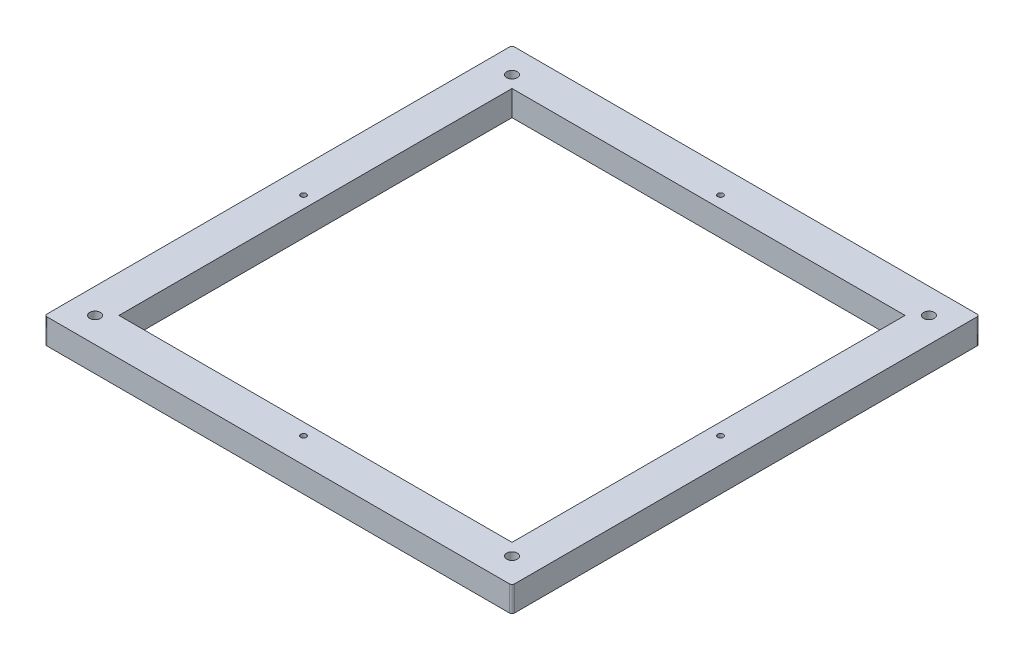
ISO-10303-21;
HEADER;
FILE_DESCRIPTION(('STEP AP214'),'2;1');
FILE_NAME('part.step','',(''),(''),'','','');
FILE_SCHEMA(('AUTOMOTIVE_DESIGN { 1 0 10303 214 1 1 1 1 }'));
ENDSEC;
DATA;
#1=APPLICATION_CONTEXT('core data for automotive mechanical design processes');
#2=APPLICATION_PROTOCOL_DEFINITION('international standard','automotive_design',2000,#1);
#3=PRODUCT_CONTEXT('',#1,'mechanical');
#4=PRODUCT('Part','Part','',(#3));
#5=PRODUCT_RELATED_PRODUCT_CATEGORY('part','',(#4));
#6=PRODUCT_DEFINITION_FORMATION('','',#4);
#7=PRODUCT_DEFINITION_CONTEXT('part definition',#1,'design');
#8=PRODUCT_DEFINITION('design','',#6,#7);
#9=PRODUCT_DEFINITION_SHAPE('','',#8);
#10=(LENGTH_UNIT() NAMED_UNIT(*) SI_UNIT(.MILLI.,.METRE.));
#11=(NAMED_UNIT(*) PLANE_ANGLE_UNIT() SI_UNIT($,.RADIAN.));
#12=(NAMED_UNIT(*) SI_UNIT($,.STERADIAN.) SOLID_ANGLE_UNIT());
#13=UNCERTAINTY_MEASURE_WITH_UNIT(LENGTH_MEASURE(1.E-05),#10,'distance_accuracy_value','');
#14=(GEOMETRIC_REPRESENTATION_CONTEXT(3) GLOBAL_UNCERTAINTY_ASSIGNED_CONTEXT((#13)) GLOBAL_UNIT_ASSIGNED_CONTEXT((#10,
#11,#12)) REPRESENTATION_CONTEXT('',''));
#15=CARTESIAN_POINT('',(0.,0.,0.));
#16=DIRECTION('',(0.,0.,1.));
#17=DIRECTION('',(1.,0.,0.));
#18=AXIS2_PLACEMENT_3D('',#15,#16,#17);
#19=CARTESIAN_POINT('',(-82.5,-10.,-82.5));
#20=DIRECTION('',(0.,1.,0.));
#21=DIRECTION('',(0.,0.,1.));
#22=AXIS2_PLACEMENT_3D('',#19,#20,#21);
#23=CYLINDRICAL_SURFACE('',#22,1.10000000000001);
#24=CARTESIAN_POINT('',(-82.5,-10.,-82.5));
#25=DIRECTION('',(0.,1.,0.));
#26=DIRECTION('',(0.,0.,1.));
#27=AXIS2_PLACEMENT_3D('',#24,#25,#26);
#28=CIRCLE('',#27,1.10000000000001);
#29=CARTESIAN_POINT('',(-82.5,-10.,-81.4));
#30=VERTEX_POINT('',#29);
#31=EDGE_CURVE('E156',#30,#30,#28,.T.);
#32=ORIENTED_EDGE('',*,*,#31,.F.);
#33=EDGE_LOOP('',(#32));
#34=FACE_BOUND('',#33,.T.);
#35=CARTESIAN_POINT('',(-82.5,-8.,-82.5));
#36=DIRECTION('',(0.,1.,0.));
#37=DIRECTION('',(0.,0.,1.));
#38=AXIS2_PLACEMENT_3D('',#35,#36,#37);
#39=CIRCLE('',#38,1.10000000000001);
#40=CARTESIAN_POINT('',(-82.5,-8.,-81.4));
#41=VERTEX_POINT('',#40);
#42=EDGE_CURVE('E38',#41,#41,#39,.F.);
#43=ORIENTED_EDGE('',*,*,#42,.F.);
#44=EDGE_LOOP('',(#43));
#45=FACE_BOUND('',#44,.T.);
#46=ADVANCED_FACE('F34',(#34,#45),#23,.F.);
#47=CARTESIAN_POINT('',(82.5,-10.,-82.5));
#48=DIRECTION('',(0.,1.,0.));
#49=DIRECTION('',(0.,0.,1.));
#50=AXIS2_PLACEMENT_3D('',#47,#48,#49);
#51=CYLINDRICAL_SURFACE('',#50,1.10000000000001);
#52=CARTESIAN_POINT('',(82.5,-10.,-82.5));
#53=DIRECTION('',(0.,1.,0.));
#54=DIRECTION('',(0.,0.,1.));
#55=AXIS2_PLACEMENT_3D('',#52,#53,#54);
#56=CIRCLE('',#55,1.10000000000001);
#57=CARTESIAN_POINT('',(82.5,-10.,-81.4));
#58=VERTEX_POINT('',#57);
#59=EDGE_CURVE('E272',#58,#58,#56,.T.);
#60=ORIENTED_EDGE('',*,*,#59,.F.);
#61=EDGE_LOOP('',(#60));
#62=FACE_BOUND('',#61,.T.);
#63=CARTESIAN_POINT('',(82.5,-8.,-82.5));
#64=DIRECTION('',(0.,1.,0.));
#65=DIRECTION('',(0.,0.,1.));
#66=AXIS2_PLACEMENT_3D('',#63,#64,#65);
#67=CIRCLE('',#66,1.10000000000001);
#68=CARTESIAN_POINT('',(82.5,-8.,-81.4));
#69=VERTEX_POINT('',#68);
#70=EDGE_CURVE('E231',#69,#69,#67,.F.);
#71=ORIENTED_EDGE('',*,*,#70,.F.);
#72=EDGE_LOOP('',(#71));
#73=FACE_BOUND('',#72,.T.);
#74=ADVANCED_FACE('F283',(#62,#73),#51,.F.);
#75=CARTESIAN_POINT('',(82.5,-10.,82.5));
#76=DIRECTION('',(0.,1.,0.));
#77=DIRECTION('',(0.,0.,1.));
#78=AXIS2_PLACEMENT_3D('',#75,#76,#77);
#79=CYLINDRICAL_SURFACE('',#78,1.10000000000001);
#80=CARTESIAN_POINT('',(82.5,-10.,82.5));
#81=DIRECTION('',(0.,1.,0.));
#82=DIRECTION('',(0.,0.,1.));
#83=AXIS2_PLACEMENT_3D('',#80,#81,#82);
#84=CIRCLE('',#83,1.10000000000001);
#85=CARTESIAN_POINT('',(82.5,-10.,83.6));
#86=VERTEX_POINT('',#85);
#87=EDGE_CURVE('E252',#86,#86,#84,.T.);
#88=ORIENTED_EDGE('',*,*,#87,.F.);
#89=EDGE_LOOP('',(#88));
#90=FACE_BOUND('',#89,.T.);
#91=CARTESIAN_POINT('',(82.5,-8.,82.5));
#92=DIRECTION('',(0.,1.,0.));
#93=DIRECTION('',(0.,0.,1.));
#94=AXIS2_PLACEMENT_3D('',#91,#92,#93);
#95=CIRCLE('',#94,1.10000000000001);
#96=CARTESIAN_POINT('',(82.5,-8.,83.6));
#97=VERTEX_POINT('',#96);
#98=EDGE_CURVE('E228',#97,#97,#95,.F.);
#99=ORIENTED_EDGE('',*,*,#98,.F.);
#100=EDGE_LOOP('',(#99));
#101=FACE_BOUND('',#100,.T.);
#102=ADVANCED_FACE('F288',(#90,#101),#79,.F.);
#103=CARTESIAN_POINT('',(-82.5,-10.,82.5));
#104=DIRECTION('',(0.,1.,0.));
#105=DIRECTION('',(0.,0.,1.));
#106=AXIS2_PLACEMENT_3D('',#103,#104,#105);
#107=CYLINDRICAL_SURFACE('',#106,1.10000000000001);
#108=CARTESIAN_POINT('',(-82.5,-10.,82.5));
#109=DIRECTION('',(0.,1.,0.));
#110=DIRECTION('',(0.,0.,1.));
#111=AXIS2_PLACEMENT_3D('',#108,#109,#110);
#112=CIRCLE('',#111,1.10000000000001);
#113=CARTESIAN_POINT('',(-82.5,-10.,83.6));
#114=VERTEX_POINT('',#113);
#115=EDGE_CURVE('E236',#114,#114,#112,.T.);
#116=ORIENTED_EDGE('',*,*,#115,.F.);
#117=EDGE_LOOP('',(#116));
#118=FACE_BOUND('',#117,.T.);
#119=CARTESIAN_POINT('',(-82.5,-8.,82.5));
#120=DIRECTION('',(0.,1.,0.));
#121=DIRECTION('',(0.,0.,1.));
#122=AXIS2_PLACEMENT_3D('',#119,#120,#121);
#123=CIRCLE('',#122,1.10000000000001);
#124=CARTESIAN_POINT('',(-82.5,-8.,83.6));
#125=VERTEX_POINT('',#124);
#126=EDGE_CURVE('E225',#125,#125,#123,.F.);
#127=ORIENTED_EDGE('',*,*,#126,.F.);
#128=EDGE_LOOP('',(#127));
#129=FACE_BOUND('',#128,.T.);
#130=ADVANCED_FACE('F326',(#118,#129),#107,.F.);
#131=CARTESIAN_POINT('',(-92.5,-10.,-92.5));
#132=DIRECTION('',(-1.,0.,0.));
#133=DIRECTION('',(0.,0.,1.));
#134=AXIS2_PLACEMENT_3D('',#131,#132,#133);
#135=PLANE('',#134);
#136=DIRECTION('',(0.,0.,1.));
#137=VECTOR('',#136,1.);
#138=CARTESIAN_POINT('',(-92.5,0.,-92.5));
#139=LINE('',#138,#137);
#140=CARTESIAN_POINT('',(-92.5,0.,-91.5));
#141=VERTEX_POINT('',#140);
#142=CARTESIAN_POINT('',(-92.5,0.,91.5));
#143=VERTEX_POINT('',#142);
#144=EDGE_CURVE('E168',#141,#143,#139,.T.);
#145=ORIENTED_EDGE('',*,*,#144,.F.);
#146=DIRECTION('',(0.,1.,0.));
#147=VECTOR('',#146,1.);
#148=CARTESIAN_POINT('',(-92.5,-10.,-91.5));
#149=LINE('',#148,#147);
#150=CARTESIAN_POINT('',(-92.5,-10.,-91.5));
#151=VERTEX_POINT('',#150);
#152=EDGE_CURVE('E210',#141,#151,#149,.F.);
#153=ORIENTED_EDGE('',*,*,#152,.T.);
#154=DIRECTION('',(0.,0.,1.));
#155=VECTOR('',#154,1.);
#156=CARTESIAN_POINT('',(-92.5,-10.,-92.5));
#157=LINE('',#156,#155);
#158=CARTESIAN_POINT('',(-92.5,-10.,91.5));
#159=VERTEX_POINT('',#158);
#160=EDGE_CURVE('E172',#151,#159,#157,.T.);
#161=ORIENTED_EDGE('',*,*,#160,.T.);
#162=DIRECTION('',(0.,1.,0.));
#163=VECTOR('',#162,1.);
#164=CARTESIAN_POINT('',(-92.5,-10.,91.5));
#165=LINE('',#164,#163);
#166=EDGE_CURVE('E207',#159,#143,#165,.T.);
#167=ORIENTED_EDGE('',*,*,#166,.T.);
#168=EDGE_LOOP('',(#145,#153,#161,#167));
#169=FACE_BOUND('',#168,.T.);
#170=ADVANCED_FACE('F317',(#169),#135,.T.);
#171=CARTESIAN_POINT('',(-92.5,-10.,-92.5));
#172=DIRECTION('',(0.,0.,-1.));
#173=DIRECTION('',(-1.,0.,0.));
#174=AXIS2_PLACEMENT_3D('',#171,#172,#173);
#175=PLANE('',#174);
#176=DIRECTION('',(-1.,0.,0.));
#177=VECTOR('',#176,1.);
#178=CARTESIAN_POINT('',(-92.5,-10.,-92.5));
#179=LINE('',#178,#177);
#180=CARTESIAN_POINT('',(91.5,-10.,-92.5));
#181=VERTEX_POINT('',#180);
#182=CARTESIAN_POINT('',(-91.5,-10.,-92.5));
#183=VERTEX_POINT('',#182);
#184=EDGE_CURVE('E181',#181,#183,#179,.T.);
#185=ORIENTED_EDGE('',*,*,#184,.T.);
#186=DIRECTION('',(0.,1.,0.));
#187=VECTOR('',#186,1.);
#188=CARTESIAN_POINT('',(-91.5,-10.,-92.5));
#189=LINE('',#188,#187);
#190=CARTESIAN_POINT('',(-91.5,0.,-92.5));
#191=VERTEX_POINT('',#190);
#192=EDGE_CURVE('E196',#183,#191,#189,.T.);
#193=ORIENTED_EDGE('',*,*,#192,.T.);
#194=DIRECTION('',(-1.,0.,0.));
#195=VECTOR('',#194,1.);
#196=CARTESIAN_POINT('',(-92.5,0.,-92.5));
#197=LINE('',#196,#195);
#198=CARTESIAN_POINT('',(91.5,0.,-92.5));
#199=VERTEX_POINT('',#198);
#200=EDGE_CURVE('E176',#199,#191,#197,.T.);
#201=ORIENTED_EDGE('',*,*,#200,.F.);
#202=DIRECTION('',(0.,1.,0.));
#203=VECTOR('',#202,1.);
#204=CARTESIAN_POINT('',(91.5,-10.,-92.5));
#205=LINE('',#204,#203);
#206=EDGE_CURVE('E184',#199,#181,#205,.F.);
#207=ORIENTED_EDGE('',*,*,#206,.T.);
#208=EDGE_LOOP('',(#185,#193,#201,#207));
#209=FACE_BOUND('',#208,.T.);
#210=ADVANCED_FACE('F313',(#209),#175,.T.);
#211=CARTESIAN_POINT('',(92.5,-10.,-92.5));
#212=DIRECTION('',(1.,0.,0.));
#213=DIRECTION('',(0.,0.,-1.));
#214=AXIS2_PLACEMENT_3D('',#211,#212,#213);
#215=PLANE('',#214);
#216=DIRECTION('',(0.,0.,-1.));
#217=VECTOR('',#216,1.);
#218=CARTESIAN_POINT('',(92.5,-10.,-92.5));
#219=LINE('',#218,#217);
#220=CARTESIAN_POINT('',(92.5,-10.,91.5));
#221=VERTEX_POINT('',#220);
#222=CARTESIAN_POINT('',(92.5,-10.,-91.5));
#223=VERTEX_POINT('',#222);
#224=EDGE_CURVE('E178',#221,#223,#219,.T.);
#225=ORIENTED_EDGE('',*,*,#224,.T.);
#226=DIRECTION('',(0.,1.,0.));
#227=VECTOR('',#226,1.);
#228=CARTESIAN_POINT('',(92.5,-10.,-91.5));
#229=LINE('',#228,#227);
#230=CARTESIAN_POINT('',(92.5,0.,-91.5));
#231=VERTEX_POINT('',#230);
#232=EDGE_CURVE('E221',#223,#231,#229,.T.);
#233=ORIENTED_EDGE('',*,*,#232,.T.);
#234=DIRECTION('',(0.,0.,-1.));
#235=VECTOR('',#234,1.);
#236=CARTESIAN_POINT('',(92.5,0.,-92.5));
#237=LINE('',#236,#235);
#238=CARTESIAN_POINT('',(92.5,0.,91.5));
#239=VERTEX_POINT('',#238);
#240=EDGE_CURVE('E190',#239,#231,#237,.T.);
#241=ORIENTED_EDGE('',*,*,#240,.F.);
#242=DIRECTION('',(0.,1.,0.));
#243=VECTOR('',#242,1.);
#244=CARTESIAN_POINT('',(92.5,-10.,91.5));
#245=LINE('',#244,#243);
#246=EDGE_CURVE('E219',#239,#221,#245,.F.);
#247=ORIENTED_EDGE('',*,*,#246,.T.);
#248=EDGE_LOOP('',(#225,#233,#241,#247));
#249=FACE_BOUND('',#248,.T.);
#250=ADVANCED_FACE('F316',(#249),#215,.T.);
#251=CARTESIAN_POINT('',(-92.5,-10.,92.5));
#252=DIRECTION('',(0.,0.,1.));
#253=DIRECTION('',(1.,0.,0.));
#254=AXIS2_PLACEMENT_3D('',#251,#252,#253);
#255=PLANE('',#254);
#256=DIRECTION('',(1.,0.,0.));
#257=VECTOR('',#256,1.);
#258=CARTESIAN_POINT('',(-92.5,-10.,92.5));
#259=LINE('',#258,#257);
#260=CARTESIAN_POINT('',(-91.5,-10.,92.5));
#261=VERTEX_POINT('',#260);
#262=CARTESIAN_POINT('',(91.5,-10.,92.5));
#263=VERTEX_POINT('',#262);
#264=EDGE_CURVE('E175',#261,#263,#259,.T.);
#265=ORIENTED_EDGE('',*,*,#264,.T.);
#266=DIRECTION('',(0.,1.,0.));
#267=VECTOR('',#266,1.);
#268=CARTESIAN_POINT('',(91.5,-10.,92.5));
#269=LINE('',#268,#267);
#270=CARTESIAN_POINT('',(91.5,0.,92.5));
#271=VERTEX_POINT('',#270);
#272=EDGE_CURVE('E11',#263,#271,#269,.T.);
#273=ORIENTED_EDGE('',*,*,#272,.T.);
#274=DIRECTION('',(1.,0.,0.));
#275=VECTOR('',#274,1.);
#276=CARTESIAN_POINT('',(-92.5,0.,92.5));
#277=LINE('',#276,#275);
#278=CARTESIAN_POINT('',(-91.5,0.,92.5));
#279=VERTEX_POINT('',#278);
#280=EDGE_CURVE('E187',#279,#271,#277,.T.);
#281=ORIENTED_EDGE('',*,*,#280,.F.);
#282=DIRECTION('',(0.,1.,0.));
#283=VECTOR('',#282,1.);
#284=CARTESIAN_POINT('',(-91.5,-10.,92.5));
#285=LINE('',#284,#283);
#286=EDGE_CURVE('E43',#279,#261,#285,.F.);
#287=ORIENTED_EDGE('',*,*,#286,.T.);
#288=EDGE_LOOP('',(#265,#273,#281,#287));
#289=FACE_BOUND('',#288,.T.);
#290=ADVANCED_FACE('F309',(#289),#255,.T.);
#291=CARTESIAN_POINT('',(0.,-10.,0.));
#292=DIRECTION('',(0.,1.,0.));
#293=DIRECTION('',(0.,0.,1.));
#294=AXIS2_PLACEMENT_3D('',#291,#292,#293);
#295=PLANE('',#294);
#296=ORIENTED_EDGE('',*,*,#115,.T.);
#297=EDGE_LOOP('',(#296));
#298=FACE_BOUND('',#297,.T.);
#299=CARTESIAN_POINT('',(0.,-10.,82.5));
#300=DIRECTION('',(0.,1.,0.));
#301=DIRECTION('',(0.,0.,1.));
#302=AXIS2_PLACEMENT_3D('',#299,#300,#301);
#303=CIRCLE('',#302,1.1);
#304=CARTESIAN_POINT('',(0.,-10.,83.6));
#305=VERTEX_POINT('',#304);
#306=EDGE_CURVE('E245',#305,#305,#303,.T.);
#307=ORIENTED_EDGE('',*,*,#306,.T.);
#308=EDGE_LOOP('',(#307));
#309=FACE_BOUND('',#308,.T.);
#310=ORIENTED_EDGE('',*,*,#87,.T.);
#311=EDGE_LOOP('',(#310));
#312=FACE_BOUND('',#311,.T.);
#313=CARTESIAN_POINT('',(82.5,-10.,0.));
#314=DIRECTION('',(0.,1.,0.));
#315=DIRECTION('',(0.,0.,1.));
#316=AXIS2_PLACEMENT_3D('',#313,#314,#315);
#317=CIRCLE('',#316,1.10000000000001);
#318=CARTESIAN_POINT('',(82.5,-10.,1.10000000000001));
#319=VERTEX_POINT('',#318);
#320=EDGE_CURVE('E257',#319,#319,#317,.T.);
#321=ORIENTED_EDGE('',*,*,#320,.T.);
#322=EDGE_LOOP('',(#321));
#323=FACE_BOUND('',#322,.T.);
#324=CARTESIAN_POINT('',(-82.5,-10.,0.));
#325=DIRECTION('',(0.,1.,0.));
#326=DIRECTION('',(0.,0.,1.));
#327=AXIS2_PLACEMENT_3D('',#324,#325,#326);
#328=CIRCLE('',#327,1.10000000000001);
#329=CARTESIAN_POINT('',(-82.5,-10.,1.10000000000001));
#330=VERTEX_POINT('',#329);
#331=EDGE_CURVE('E263',#330,#330,#328,.T.);
#332=ORIENTED_EDGE('',*,*,#331,.T.);
#333=EDGE_LOOP('',(#332));
#334=FACE_BOUND('',#333,.T.);
#335=CARTESIAN_POINT('',(0.,-10.,-82.5));
#336=DIRECTION('',(0.,1.,0.));
#337=DIRECTION('',(0.,0.,1.));
#338=AXIS2_PLACEMENT_3D('',#335,#336,#337);
#339=CIRCLE('',#338,1.1);
#340=CARTESIAN_POINT('',(0.,-10.,-81.4));
#341=VERTEX_POINT('',#340);
#342=EDGE_CURVE('E269',#341,#341,#339,.T.);
#343=ORIENTED_EDGE('',*,*,#342,.T.);
#344=EDGE_LOOP('',(#343));
#345=FACE_BOUND('',#344,.T.);
#346=ORIENTED_EDGE('',*,*,#59,.T.);
#347=EDGE_LOOP('',(#346));
#348=FACE_BOUND('',#347,.T.);
#349=ORIENTED_EDGE('',*,*,#31,.T.);
#350=EDGE_LOOP('',(#349));
#351=FACE_BOUND('',#350,.T.);
#352=DIRECTION('',(-1.,0.,0.));
#353=VECTOR('',#352,1.);
#354=CARTESIAN_POINT('',(-77.77,-10.,-77.77));
#355=LINE('',#354,#353);
#356=CARTESIAN_POINT('',(77.77,-10.,-77.77));
#357=VERTEX_POINT('',#356);
#358=CARTESIAN_POINT('',(-77.77,-10.,-77.77));
#359=VERTEX_POINT('',#358);
#360=EDGE_CURVE('E138',#357,#359,#355,.T.);
#361=ORIENTED_EDGE('',*,*,#360,.T.);
#362=DIRECTION('',(0.,0.,1.));
#363=VECTOR('',#362,1.);
#364=CARTESIAN_POINT('',(-77.77,-10.,-77.77));
#365=LINE('',#364,#363);
#366=CARTESIAN_POINT('',(-77.77,-10.,77.77));
#367=VERTEX_POINT('',#366);
#368=EDGE_CURVE('E130',#359,#367,#365,.T.);
#369=ORIENTED_EDGE('',*,*,#368,.T.);
#370=DIRECTION('',(1.,0.,0.));
#371=VECTOR('',#370,1.);
#372=CARTESIAN_POINT('',(-77.77,-10.,77.77));
#373=LINE('',#372,#371);
#374=CARTESIAN_POINT('',(77.77,-10.,77.77));
#375=VERTEX_POINT('',#374);
#376=EDGE_CURVE('E142',#367,#375,#373,.T.);
#377=ORIENTED_EDGE('',*,*,#376,.T.);
#378=DIRECTION('',(0.,0.,-1.));
#379=VECTOR('',#378,1.);
#380=CARTESIAN_POINT('',(77.77,-10.,-77.77));
#381=LINE('',#380,#379);
#382=EDGE_CURVE('E146',#375,#357,#381,.T.);
#383=ORIENTED_EDGE('',*,*,#382,.T.);
#384=EDGE_LOOP('',(#361,#369,#377,#383));
#385=FACE_BOUND('',#384,.T.);
#386=ORIENTED_EDGE('',*,*,#160,.F.);
#387=CARTESIAN_POINT('',(-91.5,-10.,-91.5));
#388=DIRECTION('',(0.,1.,0.));
#389=DIRECTION('',(0.,0.,1.));
#390=AXIS2_PLACEMENT_3D('',#387,#388,#389);
#391=CIRCLE('',#390,1.);
#392=EDGE_CURVE('E217',#151,#183,#391,.F.);
#393=ORIENTED_EDGE('',*,*,#392,.T.);
#394=ORIENTED_EDGE('',*,*,#184,.F.);
#395=CARTESIAN_POINT('',(91.5,-10.,-91.5));
#396=DIRECTION('',(0.,1.,0.));
#397=DIRECTION('',(0.,0.,1.));
#398=AXIS2_PLACEMENT_3D('',#395,#396,#397);
#399=CIRCLE('',#398,1.);
#400=EDGE_CURVE('E215',#181,#223,#399,.F.);
#401=ORIENTED_EDGE('',*,*,#400,.T.);
#402=ORIENTED_EDGE('',*,*,#224,.F.);
#403=CARTESIAN_POINT('',(91.5,-10.,91.5));
#404=DIRECTION('',(0.,1.,0.));
#405=DIRECTION('',(0.,0.,1.));
#406=AXIS2_PLACEMENT_3D('',#403,#404,#405);
#407=CIRCLE('',#406,1.);
#408=EDGE_CURVE('E51',#221,#263,#407,.F.);
#409=ORIENTED_EDGE('',*,*,#408,.T.);
#410=ORIENTED_EDGE('',*,*,#264,.F.);
#411=CARTESIAN_POINT('',(-91.5,-10.,91.5));
#412=DIRECTION('',(0.,1.,0.));
#413=DIRECTION('',(0.,0.,1.));
#414=AXIS2_PLACEMENT_3D('',#411,#412,#413);
#415=CIRCLE('',#414,1.);
#416=EDGE_CURVE('E212',#261,#159,#415,.F.);
#417=ORIENTED_EDGE('',*,*,#416,.T.);
#418=EDGE_LOOP('',(#386,#393,#394,#401,#402,#409,#410,#417));
#419=FACE_BOUND('',#418,.T.);
#420=ADVANCED_FACE('F148',(#298,#309,#312,#323,#334,#345,#348,#351,#385,#419),#295,.F.);
#421=CARTESIAN_POINT('',(0.,0.,0.));
#422=DIRECTION('',(0.,1.,0.));
#423=DIRECTION('',(0.,0.,1.));
#424=AXIS2_PLACEMENT_3D('',#421,#422,#423);
#425=PLANE('',#424);
#426=CARTESIAN_POINT('',(82.5,0.,82.5));
#427=DIRECTION('',(0.,1.,0.));
#428=DIRECTION('',(0.,0.,1.));
#429=AXIS2_PLACEMENT_3D('',#426,#427,#428);
#430=CIRCLE('',#429,2.1);
#431=CARTESIAN_POINT('',(82.5,0.,84.6));
#432=VERTEX_POINT('',#431);
#433=EDGE_CURVE('E558',#432,#432,#430,.T.);
#434=ORIENTED_EDGE('',*,*,#433,.F.);
#435=EDGE_LOOP('',(#434));
#436=FACE_BOUND('',#435,.T.);
#437=CARTESIAN_POINT('',(82.5,0.,-82.5));
#438=DIRECTION('',(0.,1.,0.));
#439=DIRECTION('',(0.,0.,1.));
#440=AXIS2_PLACEMENT_3D('',#437,#438,#439);
#441=CIRCLE('',#440,2.1);
#442=CARTESIAN_POINT('',(82.5,0.,-80.4));
#443=VERTEX_POINT('',#442);
#444=EDGE_CURVE('E550',#443,#443,#441,.T.);
#445=ORIENTED_EDGE('',*,*,#444,.F.);
#446=EDGE_LOOP('',(#445));
#447=FACE_BOUND('',#446,.T.);
#448=CARTESIAN_POINT('',(-82.5,0.,-82.5));
#449=DIRECTION('',(0.,1.,0.));
#450=DIRECTION('',(0.,0.,1.));
#451=AXIS2_PLACEMENT_3D('',#448,#449,#450);
#452=CIRCLE('',#451,2.1);
#453=CARTESIAN_POINT('',(-82.5,0.,-80.4));
#454=VERTEX_POINT('',#453);
#455=EDGE_CURVE('E544',#454,#454,#452,.T.);
#456=ORIENTED_EDGE('',*,*,#455,.F.);
#457=EDGE_LOOP('',(#456));
#458=FACE_BOUND('',#457,.T.);
#459=CARTESIAN_POINT('',(-82.5,0.,82.5));
#460=DIRECTION('',(0.,1.,0.));
#461=DIRECTION('',(0.,0.,1.));
#462=AXIS2_PLACEMENT_3D('',#459,#460,#461);
#463=CIRCLE('',#462,2.1);
#464=CARTESIAN_POINT('',(-82.5,0.,84.6));
#465=VERTEX_POINT('',#464);
#466=EDGE_CURVE('E249',#465,#465,#463,.T.);
#467=ORIENTED_EDGE('',*,*,#466,.F.);
#468=EDGE_LOOP('',(#467));
#469=FACE_BOUND('',#468,.T.);
#470=CARTESIAN_POINT('',(0.,0.,82.5));
#471=DIRECTION('',(0.,1.,0.));
#472=DIRECTION('',(0.,0.,1.));
#473=AXIS2_PLACEMENT_3D('',#470,#471,#472);
#474=CIRCLE('',#473,1.1);
#475=CARTESIAN_POINT('',(0.,0.,83.6));
#476=VERTEX_POINT('',#475);
#477=EDGE_CURVE('E240',#476,#476,#474,.T.);
#478=ORIENTED_EDGE('',*,*,#477,.F.);
#479=EDGE_LOOP('',(#478));
#480=FACE_BOUND('',#479,.T.);
#481=CARTESIAN_POINT('',(82.5,0.,0.));
#482=DIRECTION('',(0.,1.,0.));
#483=DIRECTION('',(0.,0.,1.));
#484=AXIS2_PLACEMENT_3D('',#481,#482,#483);
#485=CIRCLE('',#484,1.10000000000001);
#486=CARTESIAN_POINT('',(82.5,0.,1.10000000000001));
#487=VERTEX_POINT('',#486);
#488=EDGE_CURVE('E256',#487,#487,#485,.T.);
#489=ORIENTED_EDGE('',*,*,#488,.F.);
#490=EDGE_LOOP('',(#489));
#491=FACE_BOUND('',#490,.T.);
#492=CARTESIAN_POINT('',(-82.5,0.,0.));
#493=DIRECTION('',(0.,1.,0.));
#494=DIRECTION('',(0.,0.,1.));
#495=AXIS2_PLACEMENT_3D('',#492,#493,#494);
#496=CIRCLE('',#495,1.10000000000001);
#497=CARTESIAN_POINT('',(-82.5,0.,1.10000000000001));
#498=VERTEX_POINT('',#497);
#499=EDGE_CURVE('E260',#498,#498,#496,.T.);
#500=ORIENTED_EDGE('',*,*,#499,.F.);
#501=EDGE_LOOP('',(#500));
#502=FACE_BOUND('',#501,.T.);
#503=CARTESIAN_POINT('',(0.,0.,-82.5));
#504=DIRECTION('',(0.,1.,0.));
#505=DIRECTION('',(0.,0.,1.));
#506=AXIS2_PLACEMENT_3D('',#503,#504,#505);
#507=CIRCLE('',#506,1.1);
#508=CARTESIAN_POINT('',(0.,0.,-81.4));
#509=VERTEX_POINT('',#508);
#510=EDGE_CURVE('E266',#509,#509,#507,.T.);
#511=ORIENTED_EDGE('',*,*,#510,.F.);
#512=EDGE_LOOP('',(#511));
#513=FACE_BOUND('',#512,.T.);
#514=DIRECTION('',(0.,0.,1.));
#515=VECTOR('',#514,1.);
#516=CARTESIAN_POINT('',(-77.77,0.,-77.77));
#517=LINE('',#516,#515);
#518=CARTESIAN_POINT('',(-77.77,0.,-77.77));
#519=VERTEX_POINT('',#518);
#520=CARTESIAN_POINT('',(-77.77,0.,77.77));
#521=VERTEX_POINT('',#520);
#522=EDGE_CURVE('E133',#519,#521,#517,.T.);
#523=ORIENTED_EDGE('',*,*,#522,.F.);
#524=DIRECTION('',(-1.,0.,0.));
#525=VECTOR('',#524,1.);
#526=CARTESIAN_POINT('',(-77.77,0.,-77.77));
#527=LINE('',#526,#525);
#528=CARTESIAN_POINT('',(77.77,0.,-77.77));
#529=VERTEX_POINT('',#528);
#530=EDGE_CURVE('E150',#529,#519,#527,.T.);
#531=ORIENTED_EDGE('',*,*,#530,.F.);
#532=DIRECTION('',(0.,0.,-1.));
#533=VECTOR('',#532,1.);
#534=CARTESIAN_POINT('',(77.77,0.,-77.77));
#535=LINE('',#534,#533);
#536=CARTESIAN_POINT('',(77.77,0.,77.77));
#537=VERTEX_POINT('',#536);
#538=EDGE_CURVE('E153',#537,#529,#535,.T.);
#539=ORIENTED_EDGE('',*,*,#538,.F.);
#540=DIRECTION('',(1.,0.,0.));
#541=VECTOR('',#540,1.);
#542=CARTESIAN_POINT('',(-77.77,0.,77.77));
#543=LINE('',#542,#541);
#544=EDGE_CURVE('E162',#521,#537,#543,.T.);
#545=ORIENTED_EDGE('',*,*,#544,.F.);
#546=EDGE_LOOP('',(#523,#531,#539,#545));
#547=FACE_BOUND('',#546,.T.);
#548=ORIENTED_EDGE('',*,*,#200,.T.);
#549=CARTESIAN_POINT('',(-91.5,0.,-91.5));
#550=DIRECTION('',(0.,1.,0.));
#551=DIRECTION('',(0.,0.,1.));
#552=AXIS2_PLACEMENT_3D('',#549,#550,#551);
#553=CIRCLE('',#552,1.);
#554=EDGE_CURVE('E205',#191,#141,#553,.T.);
#555=ORIENTED_EDGE('',*,*,#554,.T.);
#556=ORIENTED_EDGE('',*,*,#144,.T.);
#557=CARTESIAN_POINT('',(-91.5,0.,91.5));
#558=DIRECTION('',(0.,1.,0.));
#559=DIRECTION('',(0.,0.,1.));
#560=AXIS2_PLACEMENT_3D('',#557,#558,#559);
#561=CIRCLE('',#560,1.);
#562=EDGE_CURVE('E199',#143,#279,#561,.T.);
#563=ORIENTED_EDGE('',*,*,#562,.T.);
#564=ORIENTED_EDGE('',*,*,#280,.T.);
#565=CARTESIAN_POINT('',(91.5,0.,91.5));
#566=DIRECTION('',(0.,1.,0.));
#567=DIRECTION('',(0.,0.,1.));
#568=AXIS2_PLACEMENT_3D('',#565,#566,#567);
#569=CIRCLE('',#568,1.);
#570=EDGE_CURVE('E201',#271,#239,#569,.T.);
#571=ORIENTED_EDGE('',*,*,#570,.T.);
#572=ORIENTED_EDGE('',*,*,#240,.T.);
#573=CARTESIAN_POINT('',(91.5,0.,-91.5));
#574=DIRECTION('',(0.,1.,0.));
#575=DIRECTION('',(0.,0.,1.));
#576=AXIS2_PLACEMENT_3D('',#573,#574,#575);
#577=CIRCLE('',#576,1.);
#578=EDGE_CURVE('E203',#231,#199,#577,.T.);
#579=ORIENTED_EDGE('',*,*,#578,.T.);
#580=EDGE_LOOP('',(#548,#555,#556,#563,#564,#571,#572,#579));
#581=FACE_BOUND('',#580,.T.);
#582=ADVANCED_FACE('F306',(#436,#447,#458,#469,#480,#491,#502,#513,#547,#581),#425,.T.);
#583=CARTESIAN_POINT('',(-77.77,-10.,-77.77));
#584=DIRECTION('',(-1.,0.,0.));
#585=DIRECTION('',(0.,0.,1.));
#586=AXIS2_PLACEMENT_3D('',#583,#584,#585);
#587=PLANE('',#586);
#588=ORIENTED_EDGE('',*,*,#522,.T.);
#589=DIRECTION('',(0.,1.,0.));
#590=VECTOR('',#589,1.);
#591=CARTESIAN_POINT('',(-77.77,-10.,77.77));
#592=LINE('',#591,#590);
#593=EDGE_CURVE('E126',#367,#521,#592,.T.);
#594=ORIENTED_EDGE('',*,*,#593,.F.);
#595=ORIENTED_EDGE('',*,*,#368,.F.);
#596=DIRECTION('',(0.,1.,0.));
#597=VECTOR('',#596,1.);
#598=CARTESIAN_POINT('',(-77.77,-10.,-77.77));
#599=LINE('',#598,#597);
#600=EDGE_CURVE('E166',#359,#519,#599,.T.);
#601=ORIENTED_EDGE('',*,*,#600,.T.);
#602=EDGE_LOOP('',(#588,#594,#595,#601));
#603=FACE_BOUND('',#602,.T.);
#604=ADVANCED_FACE('F128',(#603),#587,.F.);
#605=CARTESIAN_POINT('',(-77.77,-10.,-77.77));
#606=DIRECTION('',(0.,0.,-1.));
#607=DIRECTION('',(-1.,0.,0.));
#608=AXIS2_PLACEMENT_3D('',#605,#606,#607);
#609=PLANE('',#608);
#610=ORIENTED_EDGE('',*,*,#530,.T.);
#611=ORIENTED_EDGE('',*,*,#600,.F.);
#612=ORIENTED_EDGE('',*,*,#360,.F.);
#613=DIRECTION('',(0.,1.,0.));
#614=VECTOR('',#613,1.);
#615=CARTESIAN_POINT('',(77.77,-10.,-77.77));
#616=LINE('',#615,#614);
#617=EDGE_CURVE('E169',#357,#529,#616,.T.);
#618=ORIENTED_EDGE('',*,*,#617,.T.);
#619=EDGE_LOOP('',(#610,#611,#612,#618));
#620=FACE_BOUND('',#619,.T.);
#621=ADVANCED_FACE('F293',(#620),#609,.F.);
#622=CARTESIAN_POINT('',(77.77,-10.,-77.77));
#623=DIRECTION('',(1.,0.,0.));
#624=DIRECTION('',(0.,0.,-1.));
#625=AXIS2_PLACEMENT_3D('',#622,#623,#624);
#626=PLANE('',#625);
#627=ORIENTED_EDGE('',*,*,#538,.T.);
#628=ORIENTED_EDGE('',*,*,#617,.F.);
#629=ORIENTED_EDGE('',*,*,#382,.F.);
#630=DIRECTION('',(0.,1.,0.));
#631=VECTOR('',#630,1.);
#632=CARTESIAN_POINT('',(77.77,-10.,77.77));
#633=LINE('',#632,#631);
#634=EDGE_CURVE('E137',#375,#537,#633,.T.);
#635=ORIENTED_EDGE('',*,*,#634,.T.);
#636=EDGE_LOOP('',(#627,#628,#629,#635));
#637=FACE_BOUND('',#636,.T.);
#638=ADVANCED_FACE('F296',(#637),#626,.F.);
#639=CARTESIAN_POINT('',(-77.77,-10.,77.77));
#640=DIRECTION('',(0.,0.,1.));
#641=DIRECTION('',(1.,0.,0.));
#642=AXIS2_PLACEMENT_3D('',#639,#640,#641);
#643=PLANE('',#642);
#644=ORIENTED_EDGE('',*,*,#544,.T.);
#645=ORIENTED_EDGE('',*,*,#634,.F.);
#646=ORIENTED_EDGE('',*,*,#376,.F.);
#647=ORIENTED_EDGE('',*,*,#593,.T.);
#648=EDGE_LOOP('',(#644,#645,#646,#647));
#649=FACE_BOUND('',#648,.T.);
#650=ADVANCED_FACE('F143',(#649),#643,.F.);
#651=CARTESIAN_POINT('',(0.,-10.,-82.5));
#652=DIRECTION('',(0.,1.,0.));
#653=DIRECTION('',(0.,0.,1.));
#654=AXIS2_PLACEMENT_3D('',#651,#652,#653);
#655=CYLINDRICAL_SURFACE('',#654,1.1);
#656=ORIENTED_EDGE('',*,*,#342,.F.);
#657=EDGE_LOOP('',(#656));
#658=FACE_BOUND('',#657,.T.);
#659=ORIENTED_EDGE('',*,*,#510,.T.);
#660=EDGE_LOOP('',(#659));
#661=FACE_BOUND('',#660,.T.);
#662=ADVANCED_FACE('F303',(#658,#661),#655,.F.);
#663=CARTESIAN_POINT('',(-82.5,-10.,0.));
#664=DIRECTION('',(0.,1.,0.));
#665=DIRECTION('',(0.,0.,1.));
#666=AXIS2_PLACEMENT_3D('',#663,#664,#665);
#667=CYLINDRICAL_SURFACE('',#666,1.10000000000001);
#668=ORIENTED_EDGE('',*,*,#331,.F.);
#669=EDGE_LOOP('',(#668));
#670=FACE_BOUND('',#669,.T.);
#671=ORIENTED_EDGE('',*,*,#499,.T.);
#672=EDGE_LOOP('',(#671));
#673=FACE_BOUND('',#672,.T.);
#674=ADVANCED_FACE('F390',(#670,#673),#667,.F.);
#675=CARTESIAN_POINT('',(82.5,-10.,0.));
#676=DIRECTION('',(0.,1.,0.));
#677=DIRECTION('',(0.,0.,1.));
#678=AXIS2_PLACEMENT_3D('',#675,#676,#677);
#679=CYLINDRICAL_SURFACE('',#678,1.10000000000001);
#680=ORIENTED_EDGE('',*,*,#320,.F.);
#681=EDGE_LOOP('',(#680));
#682=FACE_BOUND('',#681,.T.);
#683=ORIENTED_EDGE('',*,*,#488,.T.);
#684=EDGE_LOOP('',(#683));
#685=FACE_BOUND('',#684,.T.);
#686=ADVANCED_FACE('F383',(#682,#685),#679,.F.);
#687=CARTESIAN_POINT('',(0.,-10.,82.5));
#688=DIRECTION('',(0.,1.,0.));
#689=DIRECTION('',(0.,0.,1.));
#690=AXIS2_PLACEMENT_3D('',#687,#688,#689);
#691=CYLINDRICAL_SURFACE('',#690,1.1);
#692=ORIENTED_EDGE('',*,*,#306,.F.);
#693=EDGE_LOOP('',(#692));
#694=FACE_BOUND('',#693,.T.);
#695=ORIENTED_EDGE('',*,*,#477,.T.);
#696=EDGE_LOOP('',(#695));
#697=FACE_BOUND('',#696,.T.);
#698=ADVANCED_FACE('F332',(#694,#697),#691,.F.);
#699=CARTESIAN_POINT('',(-91.5,-10.,-91.5));
#700=DIRECTION('',(0.,1.,0.));
#701=DIRECTION('',(0.,0.,1.));
#702=AXIS2_PLACEMENT_3D('',#699,#700,#701);
#703=CYLINDRICAL_SURFACE('',#702,1.);
#704=ORIENTED_EDGE('',*,*,#392,.F.);
#705=ORIENTED_EDGE('',*,*,#152,.F.);
#706=ORIENTED_EDGE('',*,*,#554,.F.);
#707=ORIENTED_EDGE('',*,*,#192,.F.);
#708=EDGE_LOOP('',(#704,#705,#706,#707));
#709=FACE_BOUND('',#708,.T.);
#710=ADVANCED_FACE('F328',(#709),#703,.T.);
#711=CARTESIAN_POINT('',(91.5,-10.,-91.5));
#712=DIRECTION('',(0.,1.,0.));
#713=DIRECTION('',(0.,0.,1.));
#714=AXIS2_PLACEMENT_3D('',#711,#712,#713);
#715=CYLINDRICAL_SURFACE('',#714,1.);
#716=ORIENTED_EDGE('',*,*,#400,.F.);
#717=ORIENTED_EDGE('',*,*,#206,.F.);
#718=ORIENTED_EDGE('',*,*,#578,.F.);
#719=ORIENTED_EDGE('',*,*,#232,.F.);
#720=EDGE_LOOP('',(#716,#717,#718,#719));
#721=FACE_BOUND('',#720,.T.);
#722=ADVANCED_FACE('F331',(#721),#715,.T.);
#723=CARTESIAN_POINT('',(91.5,-10.,91.5));
#724=DIRECTION('',(0.,1.,0.));
#725=DIRECTION('',(0.,0.,1.));
#726=AXIS2_PLACEMENT_3D('',#723,#724,#725);
#727=CYLINDRICAL_SURFACE('',#726,1.);
#728=ORIENTED_EDGE('',*,*,#408,.F.);
#729=ORIENTED_EDGE('',*,*,#246,.F.);
#730=ORIENTED_EDGE('',*,*,#570,.F.);
#731=ORIENTED_EDGE('',*,*,#272,.F.);
#732=EDGE_LOOP('',(#728,#729,#730,#731));
#733=FACE_BOUND('',#732,.T.);
#734=ADVANCED_FACE('F335',(#733),#727,.T.);
#735=CARTESIAN_POINT('',(-91.5,-10.,91.5));
#736=DIRECTION('',(0.,1.,0.));
#737=DIRECTION('',(0.,0.,1.));
#738=AXIS2_PLACEMENT_3D('',#735,#736,#737);
#739=CYLINDRICAL_SURFACE('',#738,1.);
#740=ORIENTED_EDGE('',*,*,#416,.F.);
#741=ORIENTED_EDGE('',*,*,#286,.F.);
#742=ORIENTED_EDGE('',*,*,#562,.F.);
#743=ORIENTED_EDGE('',*,*,#166,.F.);
#744=EDGE_LOOP('',(#740,#741,#742,#743));
#745=FACE_BOUND('',#744,.T.);
#746=ADVANCED_FACE('F36',(#745),#739,.T.);
#747=CARTESIAN_POINT('',(-82.5,-8.,82.5));
#748=DIRECTION('',(0.,1.,0.));
#749=DIRECTION('',(0.,0.,1.));
#750=AXIS2_PLACEMENT_3D('',#747,#748,#749);
#751=PLANE('',#750);
#752=CARTESIAN_POINT('',(-82.5,-8.,82.5));
#753=DIRECTION('',(0.,1.,0.));
#754=DIRECTION('',(0.,0.,1.));
#755=AXIS2_PLACEMENT_3D('',#752,#753,#754);
#756=CIRCLE('',#755,2.1);
#757=CARTESIAN_POINT('',(-82.5,-8.,84.6));
#758=VERTEX_POINT('',#757);
#759=EDGE_CURVE('E229',#758,#758,#756,.T.);
#760=ORIENTED_EDGE('',*,*,#759,.T.);
#761=EDGE_LOOP('',(#760));
#762=FACE_BOUND('',#761,.T.);
#763=ORIENTED_EDGE('',*,*,#126,.T.);
#764=EDGE_LOOP('',(#763));
#765=FACE_BOUND('',#764,.T.);
#766=ADVANCED_FACE('F342',(#762,#765),#751,.T.);
#767=CARTESIAN_POINT('',(-82.5,-8.,82.5));
#768=DIRECTION('',(0.,1.,0.));
#769=DIRECTION('',(0.,0.,1.));
#770=AXIS2_PLACEMENT_3D('',#767,#768,#769);
#771=CYLINDRICAL_SURFACE('',#770,2.1);
#772=ORIENTED_EDGE('',*,*,#759,.F.);
#773=EDGE_LOOP('',(#772));
#774=FACE_BOUND('',#773,.T.);
#775=ORIENTED_EDGE('',*,*,#466,.T.);
#776=EDGE_LOOP('',(#775));
#777=FACE_BOUND('',#776,.T.);
#778=ADVANCED_FACE('F363',(#774,#777),#771,.F.);
#779=CARTESIAN_POINT('',(82.5,-8.,82.5));
#780=DIRECTION('',(0.,1.,0.));
#781=DIRECTION('',(0.,0.,1.));
#782=AXIS2_PLACEMENT_3D('',#779,#780,#781);
#783=PLANE('',#782);
#784=CARTESIAN_POINT('',(82.5,-8.,82.5));
#785=DIRECTION('',(0.,1.,0.));
#786=DIRECTION('',(0.,0.,1.));
#787=AXIS2_PLACEMENT_3D('',#784,#785,#786);
#788=CIRCLE('',#787,2.1);
#789=CARTESIAN_POINT('',(82.5,-8.,84.6));
#790=VERTEX_POINT('',#789);
#791=EDGE_CURVE('E555',#790,#790,#788,.T.);
#792=ORIENTED_EDGE('',*,*,#791,.T.);
#793=EDGE_LOOP('',(#792));
#794=FACE_BOUND('',#793,.T.);
#795=ORIENTED_EDGE('',*,*,#98,.T.);
#796=EDGE_LOOP('',(#795));
#797=FACE_BOUND('',#796,.T.);
#798=ADVANCED_FACE('F369',(#794,#797),#783,.T.);
#799=CARTESIAN_POINT('',(82.5,-8.,82.5));
#800=DIRECTION('',(0.,1.,0.));
#801=DIRECTION('',(0.,0.,1.));
#802=AXIS2_PLACEMENT_3D('',#799,#800,#801);
#803=CYLINDRICAL_SURFACE('',#802,2.1);
#804=ORIENTED_EDGE('',*,*,#791,.F.);
#805=EDGE_LOOP('',(#804));
#806=FACE_BOUND('',#805,.T.);
#807=ORIENTED_EDGE('',*,*,#433,.T.);
#808=EDGE_LOOP('',(#807));
#809=FACE_BOUND('',#808,.T.);
#810=ADVANCED_FACE('F375',(#806,#809),#803,.F.);
#811=CARTESIAN_POINT('',(82.5,-8.,-82.5));
#812=DIRECTION('',(0.,1.,0.));
#813=DIRECTION('',(0.,0.,1.));
#814=AXIS2_PLACEMENT_3D('',#811,#812,#813);
#815=PLANE('',#814);
#816=CARTESIAN_POINT('',(82.5,-8.,-82.5));
#817=DIRECTION('',(0.,1.,0.));
#818=DIRECTION('',(0.,0.,1.));
#819=AXIS2_PLACEMENT_3D('',#816,#817,#818);
#820=CIRCLE('',#819,2.1);
#821=CARTESIAN_POINT('',(82.5,-8.,-80.4));
#822=VERTEX_POINT('',#821);
#823=EDGE_CURVE('E546',#822,#822,#820,.T.);
#824=ORIENTED_EDGE('',*,*,#823,.T.);
#825=EDGE_LOOP('',(#824));
#826=FACE_BOUND('',#825,.T.);
#827=ORIENTED_EDGE('',*,*,#70,.T.);
#828=EDGE_LOOP('',(#827));
#829=FACE_BOUND('',#828,.T.);
#830=ADVANCED_FACE('F495',(#826,#829),#815,.T.);
#831=CARTESIAN_POINT('',(82.5,-8.,-82.5));
#832=DIRECTION('',(0.,1.,0.));
#833=DIRECTION('',(0.,0.,1.));
#834=AXIS2_PLACEMENT_3D('',#831,#832,#833);
#835=CYLINDRICAL_SURFACE('',#834,2.1);
#836=ORIENTED_EDGE('',*,*,#823,.F.);
#837=EDGE_LOOP('',(#836));
#838=FACE_BOUND('',#837,.T.);
#839=ORIENTED_EDGE('',*,*,#444,.T.);
#840=EDGE_LOOP('',(#839));
#841=FACE_BOUND('',#840,.T.);
#842=ADVANCED_FACE('F504',(#838,#841),#835,.F.);
#843=CARTESIAN_POINT('',(-82.5,-8.,-82.5));
#844=DIRECTION('',(0.,1.,0.));
#845=DIRECTION('',(0.,0.,1.));
#846=AXIS2_PLACEMENT_3D('',#843,#844,#845);
#847=PLANE('',#846);
#848=CARTESIAN_POINT('',(-82.5,-8.,-82.5));
#849=DIRECTION('',(0.,1.,0.));
#850=DIRECTION('',(0.,0.,1.));
#851=AXIS2_PLACEMENT_3D('',#848,#849,#850);
#852=CIRCLE('',#851,2.1);
#853=CARTESIAN_POINT('',(-82.5,-8.,-80.4));
#854=VERTEX_POINT('',#853);
#855=EDGE_CURVE('E541',#854,#854,#852,.T.);
#856=ORIENTED_EDGE('',*,*,#855,.T.);
#857=EDGE_LOOP('',(#856));
#858=FACE_BOUND('',#857,.T.);
#859=ORIENTED_EDGE('',*,*,#42,.T.);
#860=EDGE_LOOP('',(#859));
#861=FACE_BOUND('',#860,.T.);
#862=ADVANCED_FACE('F514',(#858,#861),#847,.T.);
#863=CARTESIAN_POINT('',(-82.5,-8.,-82.5));
#864=DIRECTION('',(0.,1.,0.));
#865=DIRECTION('',(0.,0.,1.));
#866=AXIS2_PLACEMENT_3D('',#863,#864,#865);
#867=CYLINDRICAL_SURFACE('',#866,2.1);
#868=ORIENTED_EDGE('',*,*,#855,.F.);
#869=EDGE_LOOP('',(#868));
#870=FACE_BOUND('',#869,.T.);
#871=ORIENTED_EDGE('',*,*,#455,.T.);
#872=EDGE_LOOP('',(#871));
#873=FACE_BOUND('',#872,.T.);
#874=ADVANCED_FACE('F524',(#870,#873),#867,.F.);
#875=CLOSED_SHELL('',(#46,#74,#102,#130,#170,#210,#250,#290,#420,#582,#604,#621,#638,#650,#662,
#674,#686,#698,#710,#722,#734,#746,#766,#778,#798,#810,#830,#842,#862,#874));
#876=MANIFOLD_SOLID_BREP('B2',#875);
#877=ADVANCED_BREP_SHAPE_REPRESENTATION('',(#18,#876),#14);
#878=SHAPE_DEFINITION_REPRESENTATION(#9,#877);
ENDSEC;
END-ISO-10303-21;
